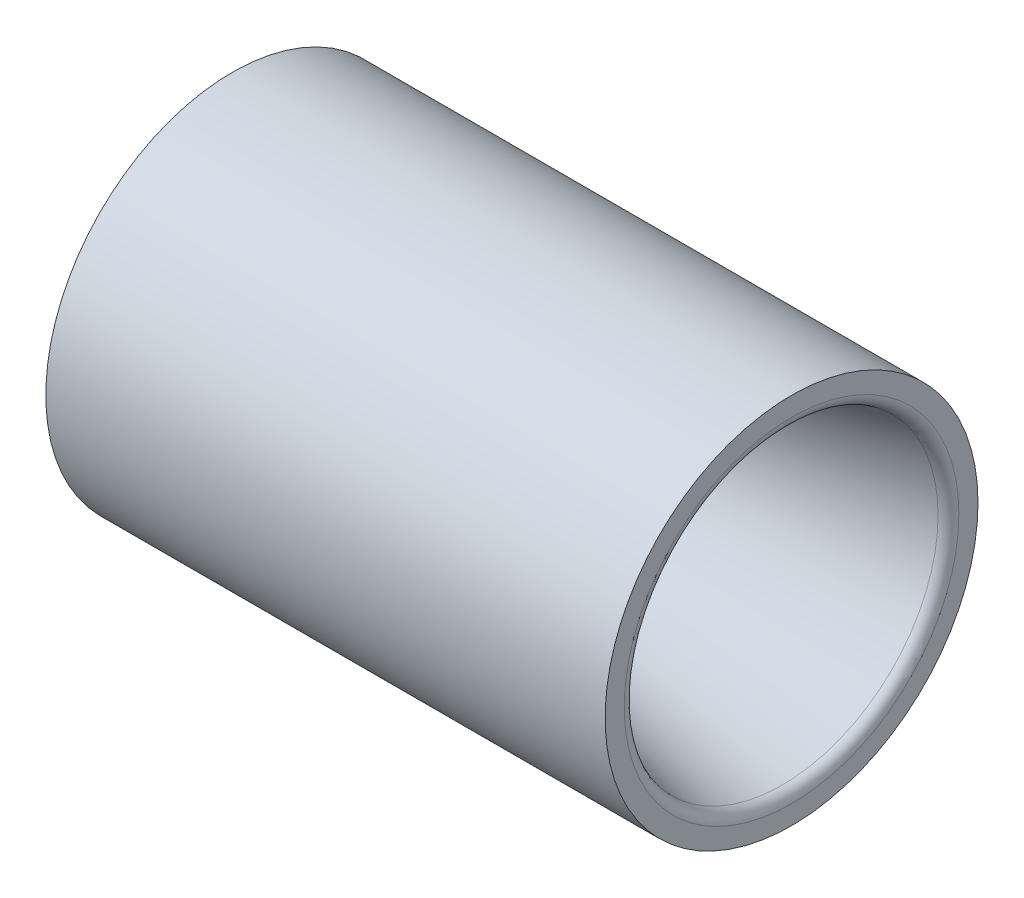
ISO-10303-21;
HEADER;
FILE_DESCRIPTION(('STEP AP214'),'2;1');
FILE_NAME('part.step','',(''),(''),'','','');
FILE_SCHEMA(('AUTOMOTIVE_DESIGN { 1 0 10303 214 1 1 1 1 }'));
ENDSEC;
DATA;
#1=APPLICATION_CONTEXT('core data for automotive mechanical design processes');
#2=APPLICATION_PROTOCOL_DEFINITION('international standard','automotive_design',2000,#1);
#3=PRODUCT_CONTEXT('',#1,'mechanical');
#4=PRODUCT('Part','Part','',(#3));
#5=PRODUCT_RELATED_PRODUCT_CATEGORY('part','',(#4));
#6=PRODUCT_DEFINITION_FORMATION('','',#4);
#7=PRODUCT_DEFINITION_CONTEXT('part definition',#1,'design');
#8=PRODUCT_DEFINITION('design','',#6,#7);
#9=PRODUCT_DEFINITION_SHAPE('','',#8);
#10=(LENGTH_UNIT() NAMED_UNIT(*) SI_UNIT(.MILLI.,.METRE.));
#11=(NAMED_UNIT(*) PLANE_ANGLE_UNIT() SI_UNIT($,.RADIAN.));
#12=(NAMED_UNIT(*) SI_UNIT($,.STERADIAN.) SOLID_ANGLE_UNIT());
#13=UNCERTAINTY_MEASURE_WITH_UNIT(LENGTH_MEASURE(1.E-05),#10,'distance_accuracy_value','');
#14=(GEOMETRIC_REPRESENTATION_CONTEXT(3) GLOBAL_UNCERTAINTY_ASSIGNED_CONTEXT((#13)) GLOBAL_UNIT_ASSIGNED_CONTEXT((#10,
#11,#12)) REPRESENTATION_CONTEXT('',''));
#15=CARTESIAN_POINT('',(0.,0.,0.));
#16=DIRECTION('',(0.,0.,1.));
#17=DIRECTION('',(1.,0.,0.));
#18=AXIS2_PLACEMENT_3D('',#15,#16,#17);
#19=CARTESIAN_POINT('',(3.175,0.,0.));
#20=DIRECTION('',(1.,0.,0.));
#21=DIRECTION('',(0.,0.,-1.));
#22=AXIS2_PLACEMENT_3D('',#19,#20,#21);
#23=CYLINDRICAL_SURFACE('',#22,9.525);
#24=CARTESIAN_POINT('',(-76.2,0.,0.));
#25=DIRECTION('',(1.,0.,0.));
#26=DIRECTION('',(0.,0.,-1.));
#27=AXIS2_PLACEMENT_3D('',#24,#25,#26);
#28=CIRCLE('',#27,9.525);
#29=CARTESIAN_POINT('',(-76.2,0.,-9.525));
#30=VERTEX_POINT('',#29);
#31=EDGE_CURVE('E10',#30,#30,#28,.T.);
#32=ORIENTED_EDGE('',*,*,#31,.F.);
#33=EDGE_LOOP('',(#32));
#34=FACE_BOUND('',#33,.T.);
#35=CARTESIAN_POINT('',(-63.5,0.,0.));
#36=DIRECTION('',(1.,0.,0.));
#37=DIRECTION('',(0.,0.,-1.));
#38=AXIS2_PLACEMENT_3D('',#35,#36,#37);
#39=CIRCLE('',#38,9.525);
#40=CARTESIAN_POINT('',(-63.5,0.,-9.525));
#41=VERTEX_POINT('',#40);
#42=EDGE_CURVE('E62',#41,#41,#39,.T.);
#43=ORIENTED_EDGE('',*,*,#42,.T.);
#44=EDGE_LOOP('',(#43));
#45=FACE_BOUND('',#44,.T.);
#46=ADVANCED_FACE('F31',(#34,#45),#23,.F.);
#47=CARTESIAN_POINT('',(-76.2,0.,25.4));
#48=DIRECTION('',(1.,0.,0.));
#49=DIRECTION('',(0.,0.,-1.));
#50=AXIS2_PLACEMENT_3D('',#47,#48,#49);
#51=PLANE('',#50);
#52=CARTESIAN_POINT('',(-76.2,0.,0.));
#53=DIRECTION('',(1.,0.,0.));
#54=DIRECTION('',(0.,0.,-1.));
#55=AXIS2_PLACEMENT_3D('',#52,#53,#54);
#56=CIRCLE('',#55,25.4);
#57=CARTESIAN_POINT('',(-76.2,0.,-25.4));
#58=VERTEX_POINT('',#57);
#59=EDGE_CURVE('E37',#58,#58,#56,.T.);
#60=ORIENTED_EDGE('',*,*,#59,.F.);
#61=EDGE_LOOP('',(#60));
#62=FACE_BOUND('',#61,.T.);
#63=ORIENTED_EDGE('',*,*,#31,.T.);
#64=EDGE_LOOP('',(#63));
#65=FACE_BOUND('',#64,.T.);
#66=ADVANCED_FACE('F105',(#62,#65),#51,.F.);
#67=CARTESIAN_POINT('',(3.175,0.,0.));
#68=DIRECTION('',(1.,0.,0.));
#69=DIRECTION('',(0.,0.,-1.));
#70=AXIS2_PLACEMENT_3D('',#67,#68,#69);
#71=CYLINDRICAL_SURFACE('',#70,25.4);
#72=CARTESIAN_POINT('',(0.,0.,0.));
#73=DIRECTION('',(1.,0.,0.));
#74=DIRECTION('',(0.,0.,-1.));
#75=AXIS2_PLACEMENT_3D('',#72,#73,#74);
#76=CIRCLE('',#75,25.4);
#77=CARTESIAN_POINT('',(0.,0.,-25.4));
#78=VERTEX_POINT('',#77);
#79=EDGE_CURVE('E41',#78,#78,#76,.T.);
#80=ORIENTED_EDGE('',*,*,#79,.F.);
#81=EDGE_LOOP('',(#80));
#82=FACE_BOUND('',#81,.T.);
#83=ORIENTED_EDGE('',*,*,#59,.T.);
#84=EDGE_LOOP('',(#83));
#85=FACE_BOUND('',#84,.T.);
#86=ADVANCED_FACE('F100',(#82,#85),#71,.T.);
#87=CARTESIAN_POINT('',(0.,0.,22.7969078194267));
#88=DIRECTION('',(-1.,0.,0.));
#89=DIRECTION('',(0.,0.,1.));
#90=AXIS2_PLACEMENT_3D('',#87,#88,#89);
#91=PLANE('',#90);
#92=CARTESIAN_POINT('',(0.,0.,0.));
#93=DIRECTION('',(1.,0.,0.));
#94=DIRECTION('',(0.,0.,-1.));
#95=AXIS2_PLACEMENT_3D('',#92,#93,#94);
#96=CIRCLE('',#95,22.7969078194267);
#97=CARTESIAN_POINT('',(0.,0.,-22.7969078194267));
#98=VERTEX_POINT('',#97);
#99=EDGE_CURVE('E45',#98,#98,#96,.T.);
#100=ORIENTED_EDGE('',*,*,#99,.F.);
#101=EDGE_LOOP('',(#100));
#102=FACE_BOUND('',#101,.T.);
#103=ORIENTED_EDGE('',*,*,#79,.T.);
#104=EDGE_LOOP('',(#103));
#105=FACE_BOUND('',#104,.T.);
#106=ADVANCED_FACE('F94',(#102,#105),#91,.F.);
#107=CARTESIAN_POINT('',(-1.6002,0.,0.));
#108=DIRECTION('',(1.,0.,0.));
#109=DIRECTION('',(0.,0.,-1.));
#110=AXIS2_PLACEMENT_3D('',#107,#108,#109);
#111=TOROIDAL_SURFACE('',#110,22.7969078194267,1.6002);
#112=CARTESIAN_POINT('',(-1.26749971235342,0.,0.));
#113=DIRECTION('',(1.,0.,0.));
#114=DIRECTION('',(0.,0.,-1.));
#115=AXIS2_PLACEMENT_3D('',#112,#113,#114);
#116=CIRCLE('',#115,21.2316760287325);
#117=CARTESIAN_POINT('',(-1.26749971235342,0.,-21.2316760287325));
#118=VERTEX_POINT('',#117);
#119=EDGE_CURVE('E50',#118,#118,#116,.T.);
#120=ORIENTED_EDGE('',*,*,#119,.F.);
#121=EDGE_LOOP('',(#120));
#122=FACE_BOUND('',#121,.T.);
#123=ORIENTED_EDGE('',*,*,#99,.T.);
#124=EDGE_LOOP('',(#123));
#125=FACE_BOUND('',#124,.T.);
#126=ADVANCED_FACE('F88',(#122,#125),#111,.T.);
#127=CARTESIAN_POINT('',(-1.26749971235342,0.,0.));
#128=DIRECTION('',(1.,0.,0.));
#129=DIRECTION('',(0.,0.,-1.));
#130=AXIS2_PLACEMENT_3D('',#127,#128,#129);
#131=CONICAL_SURFACE('',#130,21.2316760287325,0.20943951023932);
#132=CARTESIAN_POINT('',(-49.0625453144886,0.,0.));
#133=DIRECTION('',(1.,0.,0.));
#134=DIRECTION('',(0.,0.,-1.));
#135=AXIS2_PLACEMENT_3D('',#132,#133,#134);
#136=CIRCLE('',#135,11.0725254706807);
#137=CARTESIAN_POINT('',(-49.0625453144886,0.,-11.0725254706807));
#138=VERTEX_POINT('',#137);
#139=EDGE_CURVE('E53',#138,#138,#136,.T.);
#140=ORIENTED_EDGE('',*,*,#139,.F.);
#141=EDGE_LOOP('',(#140));
#142=FACE_BOUND('',#141,.T.);
#143=ORIENTED_EDGE('',*,*,#119,.T.);
#144=EDGE_LOOP('',(#143));
#145=FACE_BOUND('',#144,.T.);
#146=ADVANCED_FACE('F82',(#142,#145),#131,.F.);
#147=CARTESIAN_POINT('',(-51.7030237878741,0.,0.));
#148=DIRECTION('',(1.,0.,0.));
#149=DIRECTION('',(0.,0.,-1.));
#150=AXIS2_PLACEMENT_3D('',#147,#148,#149);
#151=TOROIDAL_SURFACE('',#150,23.495,12.7);
#152=CARTESIAN_POINT('',(-51.7030237878741,0.,0.));
#153=DIRECTION('',(1.,0.,0.));
#154=DIRECTION('',(0.,0.,-1.));
#155=AXIS2_PLACEMENT_3D('',#152,#153,#154);
#156=CIRCLE('',#155,10.795);
#157=CARTESIAN_POINT('',(-51.7030237878741,0.,-10.795));
#158=VERTEX_POINT('',#157);
#159=EDGE_CURVE('E56',#158,#158,#156,.T.);
#160=ORIENTED_EDGE('',*,*,#159,.F.);
#161=EDGE_LOOP('',(#160));
#162=FACE_BOUND('',#161,.T.);
#163=ORIENTED_EDGE('',*,*,#139,.T.);
#164=EDGE_LOOP('',(#163));
#165=FACE_BOUND('',#164,.T.);
#166=ADVANCED_FACE('F76',(#162,#165),#151,.T.);
#167=CARTESIAN_POINT('',(3.175,0.,0.));
#168=DIRECTION('',(1.,0.,0.));
#169=DIRECTION('',(0.,0.,-1.));
#170=AXIS2_PLACEMENT_3D('',#167,#168,#169);
#171=CYLINDRICAL_SURFACE('',#170,10.795);
#172=CARTESIAN_POINT('',(-63.5,0.,0.));
#173=DIRECTION('',(1.,0.,0.));
#174=DIRECTION('',(0.,0.,-1.));
#175=AXIS2_PLACEMENT_3D('',#172,#173,#174);
#176=CIRCLE('',#175,10.795);
#177=CARTESIAN_POINT('',(-63.5,0.,-10.795));
#178=VERTEX_POINT('',#177);
#179=EDGE_CURVE('E59',#178,#178,#176,.T.);
#180=ORIENTED_EDGE('',*,*,#179,.F.);
#181=EDGE_LOOP('',(#180));
#182=FACE_BOUND('',#181,.T.);
#183=ORIENTED_EDGE('',*,*,#159,.T.);
#184=EDGE_LOOP('',(#183));
#185=FACE_BOUND('',#184,.T.);
#186=ADVANCED_FACE('F70',(#182,#185),#171,.F.);
#187=CARTESIAN_POINT('',(-63.5,0.,10.795));
#188=DIRECTION('',(-1.,0.,0.));
#189=DIRECTION('',(0.,0.,1.));
#190=AXIS2_PLACEMENT_3D('',#187,#188,#189);
#191=PLANE('',#190);
#192=ORIENTED_EDGE('',*,*,#42,.F.);
#193=EDGE_LOOP('',(#192));
#194=FACE_BOUND('',#193,.T.);
#195=ORIENTED_EDGE('',*,*,#179,.T.);
#196=EDGE_LOOP('',(#195));
#197=FACE_BOUND('',#196,.T.);
#198=ADVANCED_FACE('F67',(#194,#197),#191,.F.);
#199=CLOSED_SHELL('',(#46,#66,#86,#106,#126,#146,#166,#186,#198));
#200=MANIFOLD_SOLID_BREP('B2',#199);
#201=ADVANCED_BREP_SHAPE_REPRESENTATION('',(#18,#200),#14);
#202=SHAPE_DEFINITION_REPRESENTATION(#9,#201);
ENDSEC;
END-ISO-10303-21;
